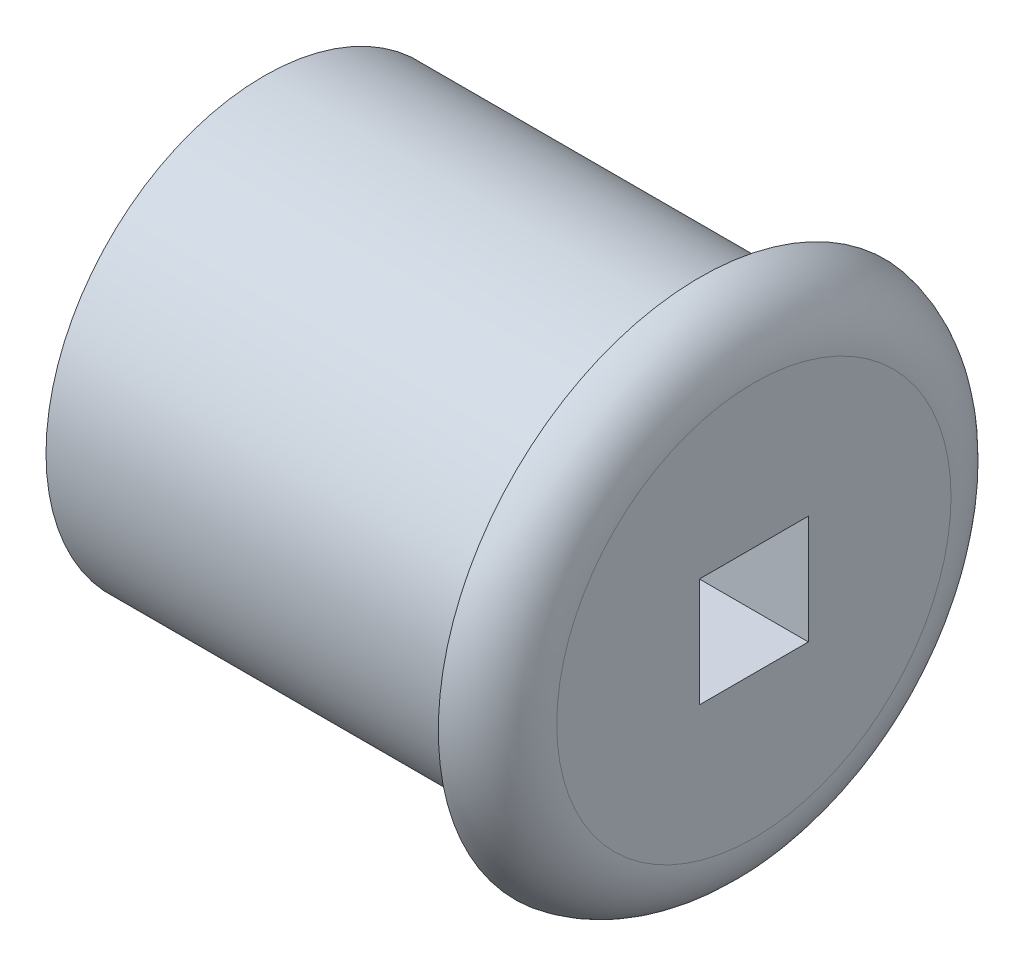
ISO-10303-21;
HEADER;
FILE_DESCRIPTION(('STEP AP214'),'2;1');
FILE_NAME('part.step','',(''),(''),'','','');
FILE_SCHEMA(('AUTOMOTIVE_DESIGN { 1 0 10303 214 1 1 1 1 }'));
ENDSEC;
DATA;
#1=APPLICATION_CONTEXT('core data for automotive mechanical design processes');
#2=APPLICATION_PROTOCOL_DEFINITION('international standard','automotive_design',2000,#1);
#3=PRODUCT_CONTEXT('',#1,'mechanical');
#4=PRODUCT('Part','Part','',(#3));
#5=PRODUCT_RELATED_PRODUCT_CATEGORY('part','',(#4));
#6=PRODUCT_DEFINITION_FORMATION('','',#4);
#7=PRODUCT_DEFINITION_CONTEXT('part definition',#1,'design');
#8=PRODUCT_DEFINITION('design','',#6,#7);
#9=PRODUCT_DEFINITION_SHAPE('','',#8);
#10=(LENGTH_UNIT() NAMED_UNIT(*) SI_UNIT(.MILLI.,.METRE.));
#11=(NAMED_UNIT(*) PLANE_ANGLE_UNIT() SI_UNIT($,.RADIAN.));
#12=(NAMED_UNIT(*) SI_UNIT($,.STERADIAN.) SOLID_ANGLE_UNIT());
#13=UNCERTAINTY_MEASURE_WITH_UNIT(LENGTH_MEASURE(1.E-05),#10,'distance_accuracy_value','');
#14=(GEOMETRIC_REPRESENTATION_CONTEXT(3) GLOBAL_UNCERTAINTY_ASSIGNED_CONTEXT((#13)) GLOBAL_UNIT_ASSIGNED_CONTEXT((#10,
#11,#12)) REPRESENTATION_CONTEXT('',''));
#15=CARTESIAN_POINT('',(0.,0.,0.));
#16=DIRECTION('',(0.,0.,1.));
#17=DIRECTION('',(1.,0.,0.));
#18=AXIS2_PLACEMENT_3D('',#15,#16,#17);
#19=CARTESIAN_POINT('',(25.4,0.,0.));
#20=DIRECTION('',(-1.,0.,0.));
#21=DIRECTION('',(0.,0.,1.));
#22=AXIS2_PLACEMENT_3D('',#19,#20,#21);
#23=CYLINDRICAL_SURFACE('',#22,12.7);
#24=CARTESIAN_POINT('',(25.4,0.,0.));
#25=DIRECTION('',(1.,0.,0.));
#26=DIRECTION('',(0.,0.,-1.));
#27=AXIS2_PLACEMENT_3D('',#24,#25,#26);
#28=CIRCLE('',#27,12.7);
#29=CARTESIAN_POINT('',(25.4,0.,-12.7));
#30=VERTEX_POINT('',#29);
#31=EDGE_CURVE('E43',#30,#30,#28,.T.);
#32=ORIENTED_EDGE('',*,*,#31,.F.);
#33=EDGE_LOOP('',(#32));
#34=FACE_BOUND('',#33,.T.);
#35=CARTESIAN_POINT('',(0.,0.,0.));
#36=DIRECTION('',(1.,0.,0.));
#37=DIRECTION('',(0.,0.,-1.));
#38=AXIS2_PLACEMENT_3D('',#35,#36,#37);
#39=CIRCLE('',#38,12.7);
#40=CARTESIAN_POINT('',(0.,0.,-12.7));
#41=VERTEX_POINT('',#40);
#42=EDGE_CURVE('E116',#41,#41,#39,.T.);
#43=ORIENTED_EDGE('',*,*,#42,.T.);
#44=EDGE_LOOP('',(#43));
#45=FACE_BOUND('',#44,.T.);
#46=ADVANCED_FACE('F35',(#34,#45),#23,.T.);
#47=CARTESIAN_POINT('',(0.,0.,0.));
#48=DIRECTION('',(1.,0.,0.));
#49=DIRECTION('',(0.,0.,-1.));
#50=AXIS2_PLACEMENT_3D('',#47,#48,#49);
#51=PLANE('',#50);
#52=ORIENTED_EDGE('',*,*,#42,.F.);
#53=EDGE_LOOP('',(#52));
#54=FACE_BOUND('',#53,.T.);
#55=ADVANCED_FACE('F122',(#54),#51,.F.);
#56=CARTESIAN_POINT('',(25.4,0.,0.));
#57=DIRECTION('',(1.,0.,0.));
#58=DIRECTION('',(0.,0.,-1.));
#59=AXIS2_PLACEMENT_3D('',#56,#57,#58);
#60=PLANE('',#59);
#61=CARTESIAN_POINT('',(25.4,0.,0.));
#62=DIRECTION('',(1.,0.,0.));
#63=DIRECTION('',(0.,0.,-1.));
#64=AXIS2_PLACEMENT_3D('',#61,#62,#63);
#65=CIRCLE('',#64,15.24);
#66=CARTESIAN_POINT('',(25.4,0.,-15.24));
#67=VERTEX_POINT('',#66);
#68=EDGE_CURVE('E111',#67,#67,#65,.T.);
#69=ORIENTED_EDGE('',*,*,#68,.F.);
#70=EDGE_LOOP('',(#69));
#71=FACE_BOUND('',#70,.T.);
#72=ORIENTED_EDGE('',*,*,#31,.T.);
#73=EDGE_LOOP('',(#72));
#74=FACE_BOUND('',#73,.T.);
#75=ADVANCED_FACE('F124',(#71,#74),#60,.F.);
#76=CARTESIAN_POINT('',(28.5496,0.,0.));
#77=DIRECTION('',(1.,0.,0.));
#78=DIRECTION('',(0.,0.,-1.));
#79=AXIS2_PLACEMENT_3D('',#76,#77,#78);
#80=PLANE('',#79);
#81=DIRECTION('',(0.,1.,0.));
#82=VECTOR('',#81,1.);
#83=CARTESIAN_POINT('',(28.5496,-3.175,-3.175));
#84=LINE('',#83,#82);
#85=CARTESIAN_POINT('',(28.5496,-3.175,-3.175));
#86=VERTEX_POINT('',#85);
#87=CARTESIAN_POINT('',(28.5496,3.175,-3.175));
#88=VERTEX_POINT('',#87);
#89=EDGE_CURVE('E50',#86,#88,#84,.T.);
#90=ORIENTED_EDGE('',*,*,#89,.F.);
#91=DIRECTION('',(0.,0.,-1.));
#92=VECTOR('',#91,1.);
#93=CARTESIAN_POINT('',(28.5496,-3.175,3.175));
#94=LINE('',#93,#92);
#95=CARTESIAN_POINT('',(28.5496,-3.175,3.175));
#96=VERTEX_POINT('',#95);
#97=EDGE_CURVE('E101',#96,#86,#94,.T.);
#98=ORIENTED_EDGE('',*,*,#97,.F.);
#99=DIRECTION('',(0.,-1.,0.));
#100=VECTOR('',#99,1.);
#101=CARTESIAN_POINT('',(28.5496,-3.175,3.175));
#102=LINE('',#101,#100);
#103=CARTESIAN_POINT('',(28.5496,3.175,3.175));
#104=VERTEX_POINT('',#103);
#105=EDGE_CURVE('E107',#104,#96,#102,.T.);
#106=ORIENTED_EDGE('',*,*,#105,.F.);
#107=DIRECTION('',(0.,0.,1.));
#108=VECTOR('',#107,1.);
#109=CARTESIAN_POINT('',(28.5496,3.175,3.175));
#110=LINE('',#109,#108);
#111=EDGE_CURVE('E85',#88,#104,#110,.T.);
#112=ORIENTED_EDGE('',*,*,#111,.F.);
#113=EDGE_LOOP('',(#90,#98,#106,#112));
#114=FACE_BOUND('',#113,.T.);
#115=CARTESIAN_POINT('',(28.5496,0.,0.));
#116=DIRECTION('',(1.,0.,0.));
#117=DIRECTION('',(0.,0.,-1.));
#118=AXIS2_PLACEMENT_3D('',#115,#116,#117);
#119=CIRCLE('',#118,11.4876711444757);
#120=CARTESIAN_POINT('',(28.5496,0.,-11.4876711444757));
#121=VERTEX_POINT('',#120);
#122=EDGE_CURVE('E11',#121,#121,#119,.T.);
#123=ORIENTED_EDGE('',*,*,#122,.T.);
#124=EDGE_LOOP('',(#123));
#125=FACE_BOUND('',#124,.T.);
#126=ADVANCED_FACE('F130',(#114,#125),#80,.T.);
#127=CARTESIAN_POINT('',(24.7396,0.,0.));
#128=DIRECTION('',(-1.,0.,0.));
#129=DIRECTION('',(0.,0.,1.));
#130=AXIS2_PLACEMENT_3D('',#127,#128,#129);
#131=TOROIDAL_SURFACE('',#130,11.4876711444757,3.81);
#132=ORIENTED_EDGE('',*,*,#68,.T.);
#133=EDGE_LOOP('',(#132));
#134=FACE_BOUND('',#133,.T.);
#135=ORIENTED_EDGE('',*,*,#122,.F.);
#136=EDGE_LOOP('',(#135));
#137=FACE_BOUND('',#136,.T.);
#138=ADVANCED_FACE('F37',(#134,#137),#131,.T.);
#139=CARTESIAN_POINT('',(15.8496,-3.175,-3.175));
#140=DIRECTION('',(0.,0.,-1.));
#141=DIRECTION('',(-1.,0.,0.));
#142=AXIS2_PLACEMENT_3D('',#139,#140,#141);
#143=PLANE('',#142);
#144=ORIENTED_EDGE('',*,*,#89,.T.);
#145=DIRECTION('',(1.,0.,0.));
#146=VECTOR('',#145,1.);
#147=CARTESIAN_POINT('',(15.8496,3.175,-3.175));
#148=LINE('',#147,#146);
#149=CARTESIAN_POINT('',(15.8496,3.175,-3.175));
#150=VERTEX_POINT('',#149);
#151=EDGE_CURVE('E73',#150,#88,#148,.T.);
#152=ORIENTED_EDGE('',*,*,#151,.F.);
#153=DIRECTION('',(0.,1.,0.));
#154=VECTOR('',#153,1.);
#155=CARTESIAN_POINT('',(15.8496,-3.175,-3.175));
#156=LINE('',#155,#154);
#157=CARTESIAN_POINT('',(15.8496,-3.175,-3.175));
#158=VERTEX_POINT('',#157);
#159=EDGE_CURVE('E99',#158,#150,#156,.T.);
#160=ORIENTED_EDGE('',*,*,#159,.F.);
#161=DIRECTION('',(1.,0.,0.));
#162=VECTOR('',#161,1.);
#163=CARTESIAN_POINT('',(15.8496,-3.175,-3.175));
#164=LINE('',#163,#162);
#165=EDGE_CURVE('E58',#158,#86,#164,.T.);
#166=ORIENTED_EDGE('',*,*,#165,.T.);
#167=EDGE_LOOP('',(#144,#152,#160,#166));
#168=FACE_BOUND('',#167,.T.);
#169=ADVANCED_FACE('F138',(#168),#143,.F.);
#170=CARTESIAN_POINT('',(15.8496,-3.175,3.175));
#171=DIRECTION('',(0.,-1.,0.));
#172=DIRECTION('',(0.,0.,-1.));
#173=AXIS2_PLACEMENT_3D('',#170,#171,#172);
#174=PLANE('',#173);
#175=ORIENTED_EDGE('',*,*,#97,.T.);
#176=ORIENTED_EDGE('',*,*,#165,.F.);
#177=DIRECTION('',(0.,0.,-1.));
#178=VECTOR('',#177,1.);
#179=CARTESIAN_POINT('',(15.8496,-3.175,3.175));
#180=LINE('',#179,#178);
#181=CARTESIAN_POINT('',(15.8496,-3.175,3.175));
#182=VERTEX_POINT('',#181);
#183=EDGE_CURVE('E96',#182,#158,#180,.T.);
#184=ORIENTED_EDGE('',*,*,#183,.F.);
#185=DIRECTION('',(1.,0.,0.));
#186=VECTOR('',#185,1.);
#187=CARTESIAN_POINT('',(15.8496,-3.175,3.175));
#188=LINE('',#187,#186);
#189=EDGE_CURVE('E89',#182,#96,#188,.T.);
#190=ORIENTED_EDGE('',*,*,#189,.T.);
#191=EDGE_LOOP('',(#175,#176,#184,#190));
#192=FACE_BOUND('',#191,.T.);
#193=ADVANCED_FACE('F141',(#192),#174,.F.);
#194=CARTESIAN_POINT('',(15.8496,-3.175,3.175));
#195=DIRECTION('',(0.,0.,1.));
#196=DIRECTION('',(1.,0.,0.));
#197=AXIS2_PLACEMENT_3D('',#194,#195,#196);
#198=PLANE('',#197);
#199=ORIENTED_EDGE('',*,*,#105,.T.);
#200=ORIENTED_EDGE('',*,*,#189,.F.);
#201=DIRECTION('',(0.,-1.,0.));
#202=VECTOR('',#201,1.);
#203=CARTESIAN_POINT('',(15.8496,-3.175,3.175));
#204=LINE('',#203,#202);
#205=CARTESIAN_POINT('',(15.8496,3.175,3.175));
#206=VERTEX_POINT('',#205);
#207=EDGE_CURVE('E92',#206,#182,#204,.T.);
#208=ORIENTED_EDGE('',*,*,#207,.F.);
#209=DIRECTION('',(1.,0.,0.));
#210=VECTOR('',#209,1.);
#211=CARTESIAN_POINT('',(15.8496,3.175,3.175));
#212=LINE('',#211,#210);
#213=EDGE_CURVE('E78',#206,#104,#212,.T.);
#214=ORIENTED_EDGE('',*,*,#213,.T.);
#215=EDGE_LOOP('',(#199,#200,#208,#214));
#216=FACE_BOUND('',#215,.T.);
#217=ADVANCED_FACE('F93',(#216),#198,.F.);
#218=CARTESIAN_POINT('',(15.8496,3.175,3.175));
#219=DIRECTION('',(0.,1.,0.));
#220=DIRECTION('',(0.,0.,1.));
#221=AXIS2_PLACEMENT_3D('',#218,#219,#220);
#222=PLANE('',#221);
#223=ORIENTED_EDGE('',*,*,#111,.T.);
#224=ORIENTED_EDGE('',*,*,#213,.F.);
#225=DIRECTION('',(0.,0.,1.));
#226=VECTOR('',#225,1.);
#227=CARTESIAN_POINT('',(15.8496,3.175,3.175));
#228=LINE('',#227,#226);
#229=EDGE_CURVE('E82',#150,#206,#228,.T.);
#230=ORIENTED_EDGE('',*,*,#229,.F.);
#231=ORIENTED_EDGE('',*,*,#151,.T.);
#232=EDGE_LOOP('',(#223,#224,#230,#231));
#233=FACE_BOUND('',#232,.T.);
#234=ADVANCED_FACE('F80',(#233),#222,.F.);
#235=CARTESIAN_POINT('',(15.8496,0.,0.));
#236=DIRECTION('',(-1.,0.,0.));
#237=DIRECTION('',(0.,0.,1.));
#238=AXIS2_PLACEMENT_3D('',#235,#236,#237);
#239=PLANE('',#238);
#240=ORIENTED_EDGE('',*,*,#159,.T.);
#241=ORIENTED_EDGE('',*,*,#229,.T.);
#242=ORIENTED_EDGE('',*,*,#207,.T.);
#243=ORIENTED_EDGE('',*,*,#183,.T.);
#244=EDGE_LOOP('',(#240,#241,#242,#243));
#245=FACE_BOUND('',#244,.T.);
#246=ADVANCED_FACE('F98',(#245),#239,.F.);
#247=CLOSED_SHELL('',(#46,#55,#75,#126,#138,#169,#193,#217,#234,#246));
#248=MANIFOLD_SOLID_BREP('B2',#247);
#249=ADVANCED_BREP_SHAPE_REPRESENTATION('',(#18,#248),#14);
#250=SHAPE_DEFINITION_REPRESENTATION(#9,#249);
ENDSEC;
END-ISO-10303-21;
